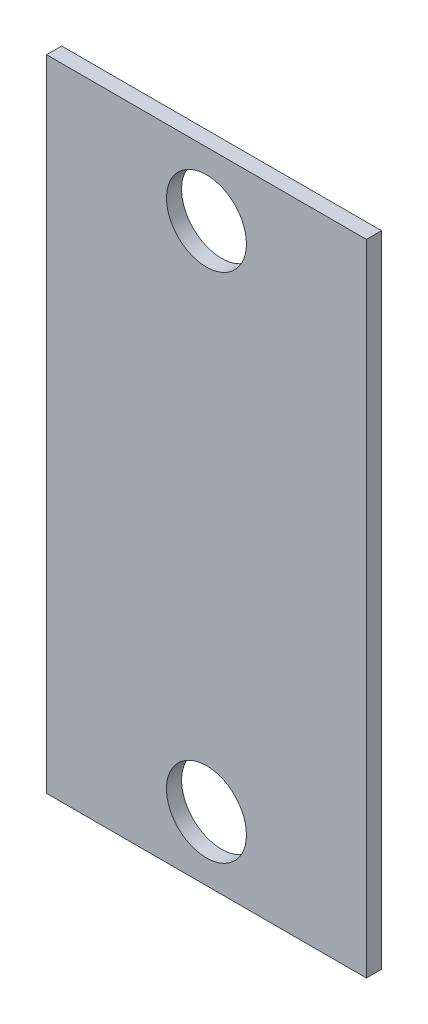
ISO-10303-21;
HEADER;
FILE_DESCRIPTION(('STEP AP214'),'2;1');
FILE_NAME('part.step','',(''),(''),'','','');
FILE_SCHEMA(('AUTOMOTIVE_DESIGN { 1 0 10303 214 1 1 1 1 }'));
ENDSEC;
DATA;
#1=APPLICATION_CONTEXT('core data for automotive mechanical design processes');
#2=APPLICATION_PROTOCOL_DEFINITION('international standard','automotive_design',2000,#1);
#3=PRODUCT_CONTEXT('',#1,'mechanical');
#4=PRODUCT('Part','Part','',(#3));
#5=PRODUCT_RELATED_PRODUCT_CATEGORY('part','',(#4));
#6=PRODUCT_DEFINITION_FORMATION('','',#4);
#7=PRODUCT_DEFINITION_CONTEXT('part definition',#1,'design');
#8=PRODUCT_DEFINITION('design','',#6,#7);
#9=PRODUCT_DEFINITION_SHAPE('','',#8);
#10=(LENGTH_UNIT() NAMED_UNIT(*) SI_UNIT(.MILLI.,.METRE.));
#11=(NAMED_UNIT(*) PLANE_ANGLE_UNIT() SI_UNIT($,.RADIAN.));
#12=(NAMED_UNIT(*) SI_UNIT($,.STERADIAN.) SOLID_ANGLE_UNIT());
#13=UNCERTAINTY_MEASURE_WITH_UNIT(LENGTH_MEASURE(1.E-05),#10,'distance_accuracy_value','');
#14=(GEOMETRIC_REPRESENTATION_CONTEXT(3) GLOBAL_UNCERTAINTY_ASSIGNED_CONTEXT((#13)) GLOBAL_UNIT_ASSIGNED_CONTEXT((#10,
#11,#12)) REPRESENTATION_CONTEXT('',''));
#15=CARTESIAN_POINT('',(0.,0.,0.));
#16=DIRECTION('',(0.,0.,1.));
#17=DIRECTION('',(1.,0.,0.));
#18=AXIS2_PLACEMENT_3D('',#15,#16,#17);
#19=CARTESIAN_POINT('',(0.,0.,2.9972));
#20=DIRECTION('',(0.,0.,1.));
#21=DIRECTION('',(1.,0.,0.));
#22=AXIS2_PLACEMENT_3D('',#19,#20,#21);
#23=PLANE('',#22);
#24=CARTESIAN_POINT('',(31.75,-114.3,2.9972));
#25=DIRECTION('',(0.,0.,1.));
#26=DIRECTION('',(1.,0.,0.));
#27=AXIS2_PLACEMENT_3D('',#24,#25,#26);
#28=CIRCLE('',#27,7.93750000000002);
#29=CARTESIAN_POINT('',(39.6875,-114.3,2.9972));
#30=VERTEX_POINT('',#29);
#31=EDGE_CURVE('E100',#30,#30,#28,.T.);
#32=ORIENTED_EDGE('',*,*,#31,.F.);
#33=EDGE_LOOP('',(#32));
#34=FACE_BOUND('',#33,.T.);
#35=DIRECTION('',(0.,-1.,0.));
#36=VECTOR('',#35,1.);
#37=CARTESIAN_POINT('',(0.,0.,2.9972));
#38=LINE('',#37,#36);
#39=CARTESIAN_POINT('',(0.,0.,2.9972));
#40=VERTEX_POINT('',#39);
#41=CARTESIAN_POINT('',(0.,-127.,2.9972));
#42=VERTEX_POINT('',#41);
#43=EDGE_CURVE('E85',#40,#42,#38,.T.);
#44=ORIENTED_EDGE('',*,*,#43,.T.);
#45=DIRECTION('',(1.,0.,0.));
#46=VECTOR('',#45,1.);
#47=CARTESIAN_POINT('',(0.,-127.,2.9972));
#48=LINE('',#47,#46);
#49=CARTESIAN_POINT('',(63.5,-127.,2.9972));
#50=VERTEX_POINT('',#49);
#51=EDGE_CURVE('E80',#42,#50,#48,.T.);
#52=ORIENTED_EDGE('',*,*,#51,.T.);
#53=DIRECTION('',(0.,1.,0.));
#54=VECTOR('',#53,1.);
#55=CARTESIAN_POINT('',(63.5,0.,2.9972));
#56=LINE('',#55,#54);
#57=CARTESIAN_POINT('',(63.5,0.,2.9972));
#58=VERTEX_POINT('',#57);
#59=EDGE_CURVE('E83',#50,#58,#56,.T.);
#60=ORIENTED_EDGE('',*,*,#59,.T.);
#61=DIRECTION('',(-1.,0.,0.));
#62=VECTOR('',#61,1.);
#63=CARTESIAN_POINT('',(0.,0.,2.9972));
#64=LINE('',#63,#62);
#65=EDGE_CURVE('E50',#58,#40,#64,.T.);
#66=ORIENTED_EDGE('',*,*,#65,.T.);
#67=EDGE_LOOP('',(#44,#52,#60,#66));
#68=FACE_BOUND('',#67,.T.);
#69=CARTESIAN_POINT('',(31.75,-12.7,2.9972));
#70=DIRECTION('',(0.,0.,1.));
#71=DIRECTION('',(1.,0.,0.));
#72=AXIS2_PLACEMENT_3D('',#69,#70,#71);
#73=CIRCLE('',#72,7.9375);
#74=CARTESIAN_POINT('',(39.6875,-12.7,2.9972));
#75=VERTEX_POINT('',#74);
#76=EDGE_CURVE('E115',#75,#75,#73,.T.);
#77=ORIENTED_EDGE('',*,*,#76,.F.);
#78=EDGE_LOOP('',(#77));
#79=FACE_BOUND('',#78,.T.);
#80=ADVANCED_FACE('F33',(#34,#68,#79),#23,.T.);
#81=CARTESIAN_POINT('',(0.,0.,0.));
#82=DIRECTION('',(0.,0.,1.));
#83=DIRECTION('',(1.,0.,0.));
#84=AXIS2_PLACEMENT_3D('',#81,#82,#83);
#85=PLANE('',#84);
#86=DIRECTION('',(0.,-1.,0.));
#87=VECTOR('',#86,1.);
#88=CARTESIAN_POINT('',(0.,0.,0.));
#89=LINE('',#88,#87);
#90=CARTESIAN_POINT('',(0.,0.,0.));
#91=VERTEX_POINT('',#90);
#92=CARTESIAN_POINT('',(0.,-127.,0.));
#93=VERTEX_POINT('',#92);
#94=EDGE_CURVE('E97',#91,#93,#89,.T.);
#95=ORIENTED_EDGE('',*,*,#94,.F.);
#96=DIRECTION('',(-1.,0.,0.));
#97=VECTOR('',#96,1.);
#98=CARTESIAN_POINT('',(0.,0.,0.));
#99=LINE('',#98,#97);
#100=CARTESIAN_POINT('',(63.5,0.,0.));
#101=VERTEX_POINT('',#100);
#102=EDGE_CURVE('E73',#101,#91,#99,.T.);
#103=ORIENTED_EDGE('',*,*,#102,.F.);
#104=DIRECTION('',(0.,1.,0.));
#105=VECTOR('',#104,1.);
#106=CARTESIAN_POINT('',(63.5,0.,0.));
#107=LINE('',#106,#105);
#108=CARTESIAN_POINT('',(63.5,-127.,0.));
#109=VERTEX_POINT('',#108);
#110=EDGE_CURVE('E67',#109,#101,#107,.T.);
#111=ORIENTED_EDGE('',*,*,#110,.F.);
#112=DIRECTION('',(1.,0.,0.));
#113=VECTOR('',#112,1.);
#114=CARTESIAN_POINT('',(0.,-127.,0.));
#115=LINE('',#114,#113);
#116=EDGE_CURVE('E89',#93,#109,#115,.T.);
#117=ORIENTED_EDGE('',*,*,#116,.F.);
#118=EDGE_LOOP('',(#95,#103,#111,#117));
#119=FACE_BOUND('',#118,.T.);
#120=CARTESIAN_POINT('',(31.75,-114.3,0.));
#121=DIRECTION('',(0.,0.,1.));
#122=DIRECTION('',(1.,0.,0.));
#123=AXIS2_PLACEMENT_3D('',#120,#121,#122);
#124=CIRCLE('',#123,7.93750000000002);
#125=CARTESIAN_POINT('',(39.6875,-114.3,0.));
#126=VERTEX_POINT('',#125);
#127=EDGE_CURVE('E112',#126,#126,#124,.T.);
#128=ORIENTED_EDGE('',*,*,#127,.T.);
#129=EDGE_LOOP('',(#128));
#130=FACE_BOUND('',#129,.T.);
#131=CARTESIAN_POINT('',(31.75,-12.7,0.));
#132=DIRECTION('',(0.,0.,1.));
#133=DIRECTION('',(1.,0.,0.));
#134=AXIS2_PLACEMENT_3D('',#131,#132,#133);
#135=CIRCLE('',#134,7.9375);
#136=CARTESIAN_POINT('',(39.6875,-12.7,0.));
#137=VERTEX_POINT('',#136);
#138=EDGE_CURVE('E118',#137,#137,#135,.T.);
#139=ORIENTED_EDGE('',*,*,#138,.T.);
#140=EDGE_LOOP('',(#139));
#141=FACE_BOUND('',#140,.T.);
#142=ADVANCED_FACE('F108',(#119,#130,#141),#85,.F.);
#143=CARTESIAN_POINT('',(0.,0.,2.9972));
#144=DIRECTION('',(1.,0.,0.));
#145=DIRECTION('',(0.,1.,0.));
#146=AXIS2_PLACEMENT_3D('',#143,#144,#145);
#147=PLANE('',#146);
#148=ORIENTED_EDGE('',*,*,#94,.T.);
#149=DIRECTION('',(0.,0.,-1.));
#150=VECTOR('',#149,1.);
#151=CARTESIAN_POINT('',(0.,-127.,2.9972));
#152=LINE('',#151,#150);
#153=EDGE_CURVE('E11',#42,#93,#152,.T.);
#154=ORIENTED_EDGE('',*,*,#153,.F.);
#155=ORIENTED_EDGE('',*,*,#43,.F.);
#156=DIRECTION('',(0.,0.,-1.));
#157=VECTOR('',#156,1.);
#158=CARTESIAN_POINT('',(0.,0.,2.9972));
#159=LINE('',#158,#157);
#160=EDGE_CURVE('E93',#40,#91,#159,.T.);
#161=ORIENTED_EDGE('',*,*,#160,.T.);
#162=EDGE_LOOP('',(#148,#154,#155,#161));
#163=FACE_BOUND('',#162,.T.);
#164=ADVANCED_FACE('F35',(#163),#147,.F.);
#165=CARTESIAN_POINT('',(0.,-127.,2.9972));
#166=DIRECTION('',(0.,1.,0.));
#167=DIRECTION('',(0.,0.,1.));
#168=AXIS2_PLACEMENT_3D('',#165,#166,#167);
#169=PLANE('',#168);
#170=ORIENTED_EDGE('',*,*,#116,.T.);
#171=DIRECTION('',(0.,0.,-1.));
#172=VECTOR('',#171,1.);
#173=CARTESIAN_POINT('',(63.5,-127.,2.9972));
#174=LINE('',#173,#172);
#175=EDGE_CURVE('E42',#50,#109,#174,.T.);
#176=ORIENTED_EDGE('',*,*,#175,.F.);
#177=ORIENTED_EDGE('',*,*,#51,.F.);
#178=ORIENTED_EDGE('',*,*,#153,.T.);
#179=EDGE_LOOP('',(#170,#176,#177,#178));
#180=FACE_BOUND('',#179,.T.);
#181=ADVANCED_FACE('F88',(#180),#169,.F.);
#182=CARTESIAN_POINT('',(63.5,0.,2.9972));
#183=DIRECTION('',(-1.,0.,0.));
#184=DIRECTION('',(0.,0.,1.));
#185=AXIS2_PLACEMENT_3D('',#182,#183,#184);
#186=PLANE('',#185);
#187=ORIENTED_EDGE('',*,*,#110,.T.);
#188=DIRECTION('',(0.,0.,-1.));
#189=VECTOR('',#188,1.);
#190=CARTESIAN_POINT('',(63.5,0.,2.9972));
#191=LINE('',#190,#189);
#192=EDGE_CURVE('E90',#58,#101,#191,.T.);
#193=ORIENTED_EDGE('',*,*,#192,.F.);
#194=ORIENTED_EDGE('',*,*,#59,.F.);
#195=ORIENTED_EDGE('',*,*,#175,.T.);
#196=EDGE_LOOP('',(#187,#193,#194,#195));
#197=FACE_BOUND('',#196,.T.);
#198=ADVANCED_FACE('F91',(#197),#186,.F.);
#199=CARTESIAN_POINT('',(0.,0.,2.9972));
#200=DIRECTION('',(0.,-1.,0.));
#201=DIRECTION('',(1.,0.,0.));
#202=AXIS2_PLACEMENT_3D('',#199,#200,#201);
#203=PLANE('',#202);
#204=ORIENTED_EDGE('',*,*,#102,.T.);
#205=ORIENTED_EDGE('',*,*,#160,.F.);
#206=ORIENTED_EDGE('',*,*,#65,.F.);
#207=ORIENTED_EDGE('',*,*,#192,.T.);
#208=EDGE_LOOP('',(#204,#205,#206,#207));
#209=FACE_BOUND('',#208,.T.);
#210=ADVANCED_FACE('F105',(#209),#203,.F.);
#211=CARTESIAN_POINT('',(31.75,-114.3,2.9972));
#212=DIRECTION('',(0.,0.,-1.));
#213=DIRECTION('',(-1.,0.,0.));
#214=AXIS2_PLACEMENT_3D('',#211,#212,#213);
#215=CYLINDRICAL_SURFACE('',#214,7.93750000000002);
#216=ORIENTED_EDGE('',*,*,#31,.T.);
#217=EDGE_LOOP('',(#216));
#218=FACE_BOUND('',#217,.T.);
#219=ORIENTED_EDGE('',*,*,#127,.F.);
#220=EDGE_LOOP('',(#219));
#221=FACE_BOUND('',#220,.T.);
#222=ADVANCED_FACE('F135',(#218,#221),#215,.F.);
#223=CARTESIAN_POINT('',(31.75,-12.7,2.9972));
#224=DIRECTION('',(0.,0.,-1.));
#225=DIRECTION('',(-1.,0.,0.));
#226=AXIS2_PLACEMENT_3D('',#223,#224,#225);
#227=CYLINDRICAL_SURFACE('',#226,7.9375);
#228=ORIENTED_EDGE('',*,*,#76,.T.);
#229=EDGE_LOOP('',(#228));
#230=FACE_BOUND('',#229,.T.);
#231=ORIENTED_EDGE('',*,*,#138,.F.);
#232=EDGE_LOOP('',(#231));
#233=FACE_BOUND('',#232,.T.);
#234=ADVANCED_FACE('F124',(#230,#233),#227,.F.);
#235=CLOSED_SHELL('',(#80,#142,#164,#181,#198,#210,#222,#234));
#236=MANIFOLD_SOLID_BREP('B2',#235);
#237=ADVANCED_BREP_SHAPE_REPRESENTATION('',(#18,#236),#14);
#238=SHAPE_DEFINITION_REPRESENTATION(#9,#237);
ENDSEC;
END-ISO-10303-21;
